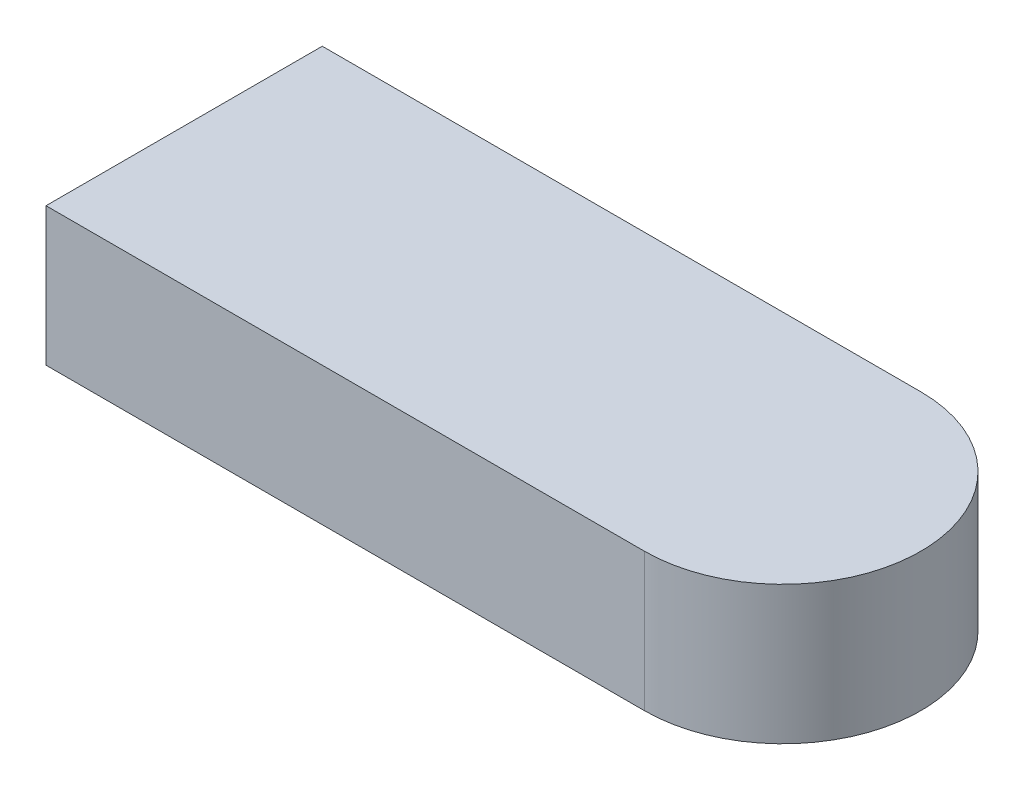
ISO-10303-21;
HEADER;
FILE_DESCRIPTION(('STEP AP214'),'2;1');
FILE_NAME('part.step','',(''),(''),'','','');
FILE_SCHEMA(('AUTOMOTIVE_DESIGN { 1 0 10303 214 1 1 1 1 }'));
ENDSEC;
DATA;
#1=APPLICATION_CONTEXT('core data for automotive mechanical design processes');
#2=APPLICATION_PROTOCOL_DEFINITION('international standard','automotive_design',2000,#1);
#3=PRODUCT_CONTEXT('',#1,'mechanical');
#4=PRODUCT('Part','Part','',(#3));
#5=PRODUCT_RELATED_PRODUCT_CATEGORY('part','',(#4));
#6=PRODUCT_DEFINITION_FORMATION('','',#4);
#7=PRODUCT_DEFINITION_CONTEXT('part definition',#1,'design');
#8=PRODUCT_DEFINITION('design','',#6,#7);
#9=PRODUCT_DEFINITION_SHAPE('','',#8);
#10=(LENGTH_UNIT() NAMED_UNIT(*) SI_UNIT(.MILLI.,.METRE.));
#11=(NAMED_UNIT(*) PLANE_ANGLE_UNIT() SI_UNIT($,.RADIAN.));
#12=(NAMED_UNIT(*) SI_UNIT($,.STERADIAN.) SOLID_ANGLE_UNIT());
#13=UNCERTAINTY_MEASURE_WITH_UNIT(LENGTH_MEASURE(1.E-05),#10,'distance_accuracy_value','');
#14=(GEOMETRIC_REPRESENTATION_CONTEXT(3) GLOBAL_UNCERTAINTY_ASSIGNED_CONTEXT((#13)) GLOBAL_UNIT_ASSIGNED_CONTEXT((#10,
#11,#12)) REPRESENTATION_CONTEXT('',''));
#15=CARTESIAN_POINT('',(0.,0.,0.));
#16=DIRECTION('',(0.,0.,1.));
#17=DIRECTION('',(1.,0.,0.));
#18=AXIS2_PLACEMENT_3D('',#15,#16,#17);
#19=CARTESIAN_POINT('',(-40.,15.,15.));
#20=DIRECTION('',(0.,0.,-1.));
#21=DIRECTION('',(-1.,0.,0.));
#22=AXIS2_PLACEMENT_3D('',#19,#20,#21);
#23=PLANE('',#22);
#24=DIRECTION('',(0.,1.,0.));
#25=VECTOR('',#24,1.);
#26=CARTESIAN_POINT('',(25.,0.,15.));
#27=LINE('',#26,#25);
#28=CARTESIAN_POINT('',(25.,0.,15.));
#29=VERTEX_POINT('',#28);
#30=CARTESIAN_POINT('',(25.,15.,15.));
#31=VERTEX_POINT('',#30);
#32=EDGE_CURVE('E91',#29,#31,#27,.T.);
#33=ORIENTED_EDGE('',*,*,#32,.T.);
#34=DIRECTION('',(1.,0.,0.));
#35=VECTOR('',#34,1.);
#36=CARTESIAN_POINT('',(-40.,15.,15.));
#37=LINE('',#36,#35);
#38=CARTESIAN_POINT('',(-40.,15.,15.));
#39=VERTEX_POINT('',#38);
#40=EDGE_CURVE('E113',#39,#31,#37,.T.);
#41=ORIENTED_EDGE('',*,*,#40,.F.);
#42=DIRECTION('',(0.,-1.,0.));
#43=VECTOR('',#42,1.);
#44=CARTESIAN_POINT('',(-40.,15.,15.));
#45=LINE('',#44,#43);
#46=CARTESIAN_POINT('',(-40.,0.,15.));
#47=VERTEX_POINT('',#46);
#48=EDGE_CURVE('E11',#39,#47,#45,.T.);
#49=ORIENTED_EDGE('',*,*,#48,.T.);
#50=DIRECTION('',(1.,0.,0.));
#51=VECTOR('',#50,1.);
#52=CARTESIAN_POINT('',(-40.,0.,15.));
#53=LINE('',#52,#51);
#54=EDGE_CURVE('E68',#47,#29,#53,.T.);
#55=ORIENTED_EDGE('',*,*,#54,.T.);
#56=EDGE_LOOP('',(#33,#41,#49,#55));
#57=FACE_BOUND('',#56,.T.);
#58=ADVANCED_FACE('F38',(#57),#23,.F.);
#59=CARTESIAN_POINT('',(-40.,15.,-15.));
#60=DIRECTION('',(1.,0.,0.));
#61=DIRECTION('',(0.,0.,-1.));
#62=AXIS2_PLACEMENT_3D('',#59,#60,#61);
#63=PLANE('',#62);
#64=DIRECTION('',(0.,0.,1.));
#65=VECTOR('',#64,1.);
#66=CARTESIAN_POINT('',(-40.,0.,-15.));
#67=LINE('',#66,#65);
#68=CARTESIAN_POINT('',(-40.,0.,-15.));
#69=VERTEX_POINT('',#68);
#70=EDGE_CURVE('E100',#69,#47,#67,.T.);
#71=ORIENTED_EDGE('',*,*,#70,.T.);
#72=ORIENTED_EDGE('',*,*,#48,.F.);
#73=DIRECTION('',(0.,0.,1.));
#74=VECTOR('',#73,1.);
#75=CARTESIAN_POINT('',(-40.,15.,-15.));
#76=LINE('',#75,#74);
#77=CARTESIAN_POINT('',(-40.,15.,-15.));
#78=VERTEX_POINT('',#77);
#79=EDGE_CURVE('E104',#78,#39,#76,.T.);
#80=ORIENTED_EDGE('',*,*,#79,.F.);
#81=DIRECTION('',(0.,-1.,0.));
#82=VECTOR('',#81,1.);
#83=CARTESIAN_POINT('',(-40.,15.,-15.));
#84=LINE('',#83,#82);
#85=EDGE_CURVE('E48',#78,#69,#84,.T.);
#86=ORIENTED_EDGE('',*,*,#85,.T.);
#87=EDGE_LOOP('',(#71,#72,#80,#86));
#88=FACE_BOUND('',#87,.T.);
#89=ADVANCED_FACE('F40',(#88),#63,.F.);
#90=CARTESIAN_POINT('',(-40.,15.,-15.));
#91=DIRECTION('',(0.,0.,1.));
#92=DIRECTION('',(1.,0.,0.));
#93=AXIS2_PLACEMENT_3D('',#90,#91,#92);
#94=PLANE('',#93);
#95=DIRECTION('',(-1.,0.,0.));
#96=VECTOR('',#95,1.);
#97=CARTESIAN_POINT('',(-40.,15.,-15.));
#98=LINE('',#97,#96);
#99=CARTESIAN_POINT('',(25.,15.,-15.));
#100=VERTEX_POINT('',#99);
#101=EDGE_CURVE('E56',#100,#78,#98,.T.);
#102=ORIENTED_EDGE('',*,*,#101,.F.);
#103=DIRECTION('',(0.,1.,0.));
#104=VECTOR('',#103,1.);
#105=CARTESIAN_POINT('',(25.,0.,-15.));
#106=LINE('',#105,#104);
#107=CARTESIAN_POINT('',(25.,0.,-15.));
#108=VERTEX_POINT('',#107);
#109=EDGE_CURVE('E87',#108,#100,#106,.T.);
#110=ORIENTED_EDGE('',*,*,#109,.F.);
#111=DIRECTION('',(-1.,0.,0.));
#112=VECTOR('',#111,1.);
#113=CARTESIAN_POINT('',(-40.,0.,-15.));
#114=LINE('',#113,#112);
#115=EDGE_CURVE('E85',#108,#69,#114,.T.);
#116=ORIENTED_EDGE('',*,*,#115,.T.);
#117=ORIENTED_EDGE('',*,*,#85,.F.);
#118=EDGE_LOOP('',(#102,#110,#116,#117));
#119=FACE_BOUND('',#118,.T.);
#120=ADVANCED_FACE('F124',(#119),#94,.F.);
#121=CARTESIAN_POINT('',(0.,15.,0.));
#122=DIRECTION('',(0.,1.,0.));
#123=DIRECTION('',(0.,0.,1.));
#124=AXIS2_PLACEMENT_3D('',#121,#122,#123);
#125=PLANE('',#124);
#126=ORIENTED_EDGE('',*,*,#40,.T.);
#127=CARTESIAN_POINT('',(25.,15.,0.));
#128=DIRECTION('',(0.,-1.,0.));
#129=DIRECTION('',(0.,0.,1.));
#130=AXIS2_PLACEMENT_3D('',#127,#128,#129);
#131=CIRCLE('',#130,15.);
#132=EDGE_CURVE('E88',#100,#31,#131,.T.);
#133=ORIENTED_EDGE('',*,*,#132,.F.);
#134=ORIENTED_EDGE('',*,*,#101,.T.);
#135=ORIENTED_EDGE('',*,*,#79,.T.);
#136=EDGE_LOOP('',(#126,#133,#134,#135));
#137=FACE_BOUND('',#136,.T.);
#138=ADVANCED_FACE('F123',(#137),#125,.T.);
#139=CARTESIAN_POINT('',(0.,0.,0.));
#140=DIRECTION('',(0.,1.,0.));
#141=DIRECTION('',(0.,0.,1.));
#142=AXIS2_PLACEMENT_3D('',#139,#140,#141);
#143=PLANE('',#142);
#144=CARTESIAN_POINT('',(25.,0.,0.));
#145=DIRECTION('',(0.,-1.,0.));
#146=DIRECTION('',(0.,0.,1.));
#147=AXIS2_PLACEMENT_3D('',#144,#145,#146);
#148=CIRCLE('',#147,15.);
#149=EDGE_CURVE('E76',#108,#29,#148,.T.);
#150=ORIENTED_EDGE('',*,*,#149,.T.);
#151=ORIENTED_EDGE('',*,*,#54,.F.);
#152=ORIENTED_EDGE('',*,*,#70,.F.);
#153=ORIENTED_EDGE('',*,*,#115,.F.);
#154=EDGE_LOOP('',(#150,#151,#152,#153));
#155=FACE_BOUND('',#154,.T.);
#156=ADVANCED_FACE('F84',(#155),#143,.F.);
#157=CARTESIAN_POINT('',(25.,0.,0.));
#158=DIRECTION('',(0.,1.,0.));
#159=DIRECTION('',(0.,0.,1.));
#160=AXIS2_PLACEMENT_3D('',#157,#158,#159);
#161=CYLINDRICAL_SURFACE('',#160,15.);
#162=ORIENTED_EDGE('',*,*,#132,.T.);
#163=ORIENTED_EDGE('',*,*,#32,.F.);
#164=ORIENTED_EDGE('',*,*,#149,.F.);
#165=ORIENTED_EDGE('',*,*,#109,.T.);
#166=EDGE_LOOP('',(#162,#163,#164,#165));
#167=FACE_BOUND('',#166,.T.);
#168=ADVANCED_FACE('F92',(#167),#161,.T.);
#169=CLOSED_SHELL('',(#58,#89,#120,#138,#156,#168));
#170=MANIFOLD_SOLID_BREP('B2',#169);
#171=ADVANCED_BREP_SHAPE_REPRESENTATION('',(#18,#170),#14);
#172=SHAPE_DEFINITION_REPRESENTATION(#9,#171);
ENDSEC;
END-ISO-10303-21;
